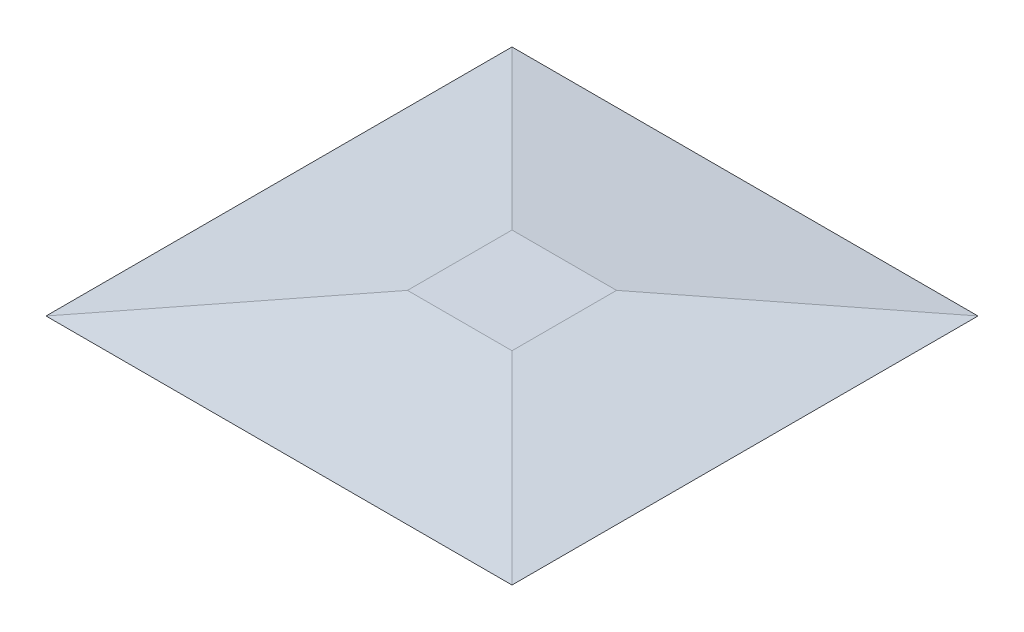
ISO-10303-21;
HEADER;
FILE_DESCRIPTION(('STEP AP214'),'2;1');
FILE_NAME('part.step','',(''),(''),'','','');
FILE_SCHEMA(('AUTOMOTIVE_DESIGN { 1 0 10303 214 1 1 1 1 }'));
ENDSEC;
DATA;
#1=APPLICATION_CONTEXT('core data for automotive mechanical design processes');
#2=APPLICATION_PROTOCOL_DEFINITION('international standard','automotive_design',2000,#1);
#3=PRODUCT_CONTEXT('',#1,'mechanical');
#4=PRODUCT('Part','Part','',(#3));
#5=PRODUCT_RELATED_PRODUCT_CATEGORY('part','',(#4));
#6=PRODUCT_DEFINITION_FORMATION('','',#4);
#7=PRODUCT_DEFINITION_CONTEXT('part definition',#1,'design');
#8=PRODUCT_DEFINITION('design','',#6,#7);
#9=PRODUCT_DEFINITION_SHAPE('','',#8);
#10=(LENGTH_UNIT() NAMED_UNIT(*) SI_UNIT(.MILLI.,.METRE.));
#11=(NAMED_UNIT(*) PLANE_ANGLE_UNIT() SI_UNIT($,.RADIAN.));
#12=(NAMED_UNIT(*) SI_UNIT($,.STERADIAN.) SOLID_ANGLE_UNIT());
#13=UNCERTAINTY_MEASURE_WITH_UNIT(LENGTH_MEASURE(1.E-05),#10,'distance_accuracy_value','');
#14=(GEOMETRIC_REPRESENTATION_CONTEXT(3) GLOBAL_UNCERTAINTY_ASSIGNED_CONTEXT((#13)) GLOBAL_UNIT_ASSIGNED_CONTEXT((#10,
#11,#12)) REPRESENTATION_CONTEXT('',''));
#15=CARTESIAN_POINT('',(0.,0.,0.));
#16=DIRECTION('',(0.,0.,1.));
#17=DIRECTION('',(1.,0.,0.));
#18=AXIS2_PLACEMENT_3D('',#15,#16,#17);
#19=CARTESIAN_POINT('',(-38.7180212497152,0.,29.3150333499824));
#20=DIRECTION('',(-0.121869343405146,0.992546151641322,0.));
#21=DIRECTION('',(-0.992546151641322,-0.121869343405146,0.));
#22=AXIS2_PLACEMENT_3D('',#19,#20,#21);
#23=PLANE('',#22);
#24=DIRECTION('',(0.,0.,1.));
#25=VECTOR('',#24,1.);
#26=CARTESIAN_POINT('',(-38.7180212497152,0.,29.3150333499824));
#27=LINE('',#26,#25);
#28=CARTESIAN_POINT('',(-38.7180212497152,0.,-24.0249666500176));
#29=VERTEX_POINT('',#28);
#30=CARTESIAN_POINT('',(-38.7180212497152,0.,29.3150333499824));
#31=VERTEX_POINT('',#30);
#32=EDGE_CURVE('E79',#29,#31,#27,.T.);
#33=ORIENTED_EDGE('',*,*,#32,.T.);
#34=DIRECTION('',(-0.704456660303224,-0.0864964017104568,0.704456660303224));
#35=VECTOR('',#34,1.);
#36=CARTESIAN_POINT('',(-38.7180212497152,0.,29.3150333499824));
#37=LINE('',#36,#35);
#38=CARTESIAN_POINT('',(-18.0313813226595,2.54,8.62839342292662));
#39=VERTEX_POINT('',#38);
#40=EDGE_CURVE('E11',#39,#31,#37,.T.);
#41=ORIENTED_EDGE('',*,*,#40,.F.);
#42=DIRECTION('',(0.,0.,-1.));
#43=VECTOR('',#42,1.);
#44=CARTESIAN_POINT('',(-18.0313813226595,2.54,0.));
#45=LINE('',#44,#43);
#46=CARTESIAN_POINT('',(-18.0313813226595,2.54,-3.33832672296188));
#47=VERTEX_POINT('',#46);
#48=EDGE_CURVE('E95',#47,#39,#45,.F.);
#49=ORIENTED_EDGE('',*,*,#48,.F.);
#50=DIRECTION('',(-0.704456660303224,-0.0864964017104568,-0.704456660303224));
#51=VECTOR('',#50,1.);
#52=CARTESIAN_POINT('',(-12.2475562553764,3.25016442122555,2.44549834432116));
#53=LINE('',#52,#51);
#54=EDGE_CURVE('E90',#47,#29,#53,.T.);
#55=ORIENTED_EDGE('',*,*,#54,.T.);
#56=EDGE_LOOP('',(#33,#41,#49,#55));
#57=FACE_BOUND('',#56,.T.);
#58=ADVANCED_FACE('F33',(#57),#23,.T.);
#59=CARTESIAN_POINT('',(-38.7180212497152,0.,29.3150333499824));
#60=DIRECTION('',(0.,0.992546151641322,0.121869343405146));
#61=DIRECTION('',(0.,-0.121869343405146,0.992546151641322));
#62=AXIS2_PLACEMENT_3D('',#59,#60,#61);
#63=PLANE('',#62);
#64=DIRECTION('',(1.,0.,0.));
#65=VECTOR('',#64,1.);
#66=CARTESIAN_POINT('',(-38.7180212497152,0.,29.3150333499824));
#67=LINE('',#66,#65);
#68=CARTESIAN_POINT('',(14.6219787502848,0.,29.3150333499824));
#69=VERTEX_POINT('',#68);
#70=EDGE_CURVE('E75',#31,#69,#67,.T.);
#71=ORIENTED_EDGE('',*,*,#70,.T.);
#72=DIRECTION('',(0.704456660303224,-0.0864964017104568,0.704456660303224));
#73=VECTOR('',#72,1.);
#74=CARTESIAN_POINT('',(14.6219787502848,0.,29.3150333499824));
#75=LINE('',#74,#73);
#76=CARTESIAN_POINT('',(-6.06466117677099,2.54,8.62839342292662));
#77=VERTEX_POINT('',#76);
#78=EDGE_CURVE('E42',#77,#69,#75,.T.);
#79=ORIENTED_EDGE('',*,*,#78,.F.);
#80=DIRECTION('',(-1.,0.,0.));
#81=VECTOR('',#80,1.);
#82=CARTESIAN_POINT('',(0.,2.54,8.62839342292662));
#83=LINE('',#82,#81);
#84=EDGE_CURVE('E86',#39,#77,#83,.F.);
#85=ORIENTED_EDGE('',*,*,#84,.F.);
#86=ORIENTED_EDGE('',*,*,#40,.T.);
#87=EDGE_LOOP('',(#71,#79,#85,#86));
#88=FACE_BOUND('',#87,.T.);
#89=ADVANCED_FACE('F35',(#88),#63,.T.);
#90=CARTESIAN_POINT('',(14.6219787502848,0.,29.3150333499824));
#91=DIRECTION('',(0.121869343405146,0.992546151641322,0.));
#92=DIRECTION('',(-0.992546151641322,0.121869343405146,0.));
#93=AXIS2_PLACEMENT_3D('',#90,#91,#92);
#94=PLANE('',#93);
#95=DIRECTION('',(0.,0.,-1.));
#96=VECTOR('',#95,1.);
#97=CARTESIAN_POINT('',(14.6219787502848,0.,29.3150333499824));
#98=LINE('',#97,#96);
#99=CARTESIAN_POINT('',(14.6219787502848,0.,-24.0249666500176));
#100=VERTEX_POINT('',#99);
#101=EDGE_CURVE('E80',#69,#100,#98,.T.);
#102=ORIENTED_EDGE('',*,*,#101,.T.);
#103=DIRECTION('',(0.704456660303224,-0.0864964017104568,-0.704456660303224));
#104=VECTOR('',#103,1.);
#105=CARTESIAN_POINT('',(-11.848486244054,3.25016442122555,2.44549834432116));
#106=LINE('',#105,#104);
#107=CARTESIAN_POINT('',(-6.06466117677099,2.54,-3.33832672296188));
#108=VERTEX_POINT('',#107);
#109=EDGE_CURVE('E98',#108,#100,#106,.T.);
#110=ORIENTED_EDGE('',*,*,#109,.F.);
#111=DIRECTION('',(0.,0.,1.));
#112=VECTOR('',#111,1.);
#113=CARTESIAN_POINT('',(-6.06466117677099,2.54,0.));
#114=LINE('',#113,#112);
#115=EDGE_CURVE('E54',#77,#108,#114,.F.);
#116=ORIENTED_EDGE('',*,*,#115,.F.);
#117=ORIENTED_EDGE('',*,*,#78,.T.);
#118=EDGE_LOOP('',(#102,#110,#116,#117));
#119=FACE_BOUND('',#118,.T.);
#120=ADVANCED_FACE('F105',(#119),#94,.T.);
#121=CARTESIAN_POINT('',(-38.7180212497152,0.,-24.0249666500176));
#122=DIRECTION('',(0.,0.992546151641322,-0.121869343405146));
#123=DIRECTION('',(0.,0.121869343405146,0.992546151641322));
#124=AXIS2_PLACEMENT_3D('',#121,#122,#123);
#125=PLANE('',#124);
#126=DIRECTION('',(-1.,0.,0.));
#127=VECTOR('',#126,1.);
#128=CARTESIAN_POINT('',(-38.7180212497152,0.,-24.0249666500176));
#129=LINE('',#128,#127);
#130=EDGE_CURVE('E94',#100,#29,#129,.T.);
#131=ORIENTED_EDGE('',*,*,#130,.T.);
#132=ORIENTED_EDGE('',*,*,#54,.F.);
#133=DIRECTION('',(1.,0.,0.));
#134=VECTOR('',#133,1.);
#135=CARTESIAN_POINT('',(0.,2.54,-3.33832672296189));
#136=LINE('',#135,#134);
#137=EDGE_CURVE('E37',#108,#47,#136,.F.);
#138=ORIENTED_EDGE('',*,*,#137,.F.);
#139=ORIENTED_EDGE('',*,*,#109,.T.);
#140=EDGE_LOOP('',(#131,#132,#138,#139));
#141=FACE_BOUND('',#140,.T.);
#142=ADVANCED_FACE('F107',(#141),#125,.T.);
#143=CARTESIAN_POINT('',(0.,2.54,0.));
#144=DIRECTION('',(0.,-1.,0.));
#145=DIRECTION('',(0.,0.,-1.));
#146=AXIS2_PLACEMENT_3D('',#143,#144,#145);
#147=PLANE('',#146);
#148=ORIENTED_EDGE('',*,*,#48,.T.);
#149=ORIENTED_EDGE('',*,*,#84,.T.);
#150=ORIENTED_EDGE('',*,*,#115,.T.);
#151=ORIENTED_EDGE('',*,*,#137,.T.);
#152=EDGE_LOOP('',(#148,#149,#150,#151));
#153=FACE_BOUND('',#152,.T.);
#154=ADVANCED_FACE('F103',(#153),#147,.F.);
#155=CARTESIAN_POINT('',(0.,0.,0.));
#156=DIRECTION('',(0.,-1.,0.));
#157=DIRECTION('',(0.,0.,-1.));
#158=AXIS2_PLACEMENT_3D('',#155,#156,#157);
#159=PLANE('',#158);
#160=ORIENTED_EDGE('',*,*,#32,.F.);
#161=ORIENTED_EDGE('',*,*,#130,.F.);
#162=ORIENTED_EDGE('',*,*,#101,.F.);
#163=ORIENTED_EDGE('',*,*,#70,.F.);
#164=EDGE_LOOP('',(#160,#161,#162,#163));
#165=FACE_BOUND('',#164,.T.);
#166=ADVANCED_FACE('F76',(#165),#159,.T.);
#167=CLOSED_SHELL('',(#58,#89,#120,#142,#154,#166));
#168=MANIFOLD_SOLID_BREP('B2',#167);
#169=ADVANCED_BREP_SHAPE_REPRESENTATION('',(#18,#168),#14);
#170=SHAPE_DEFINITION_REPRESENTATION(#9,#169);
ENDSEC;
END-ISO-10303-21;
